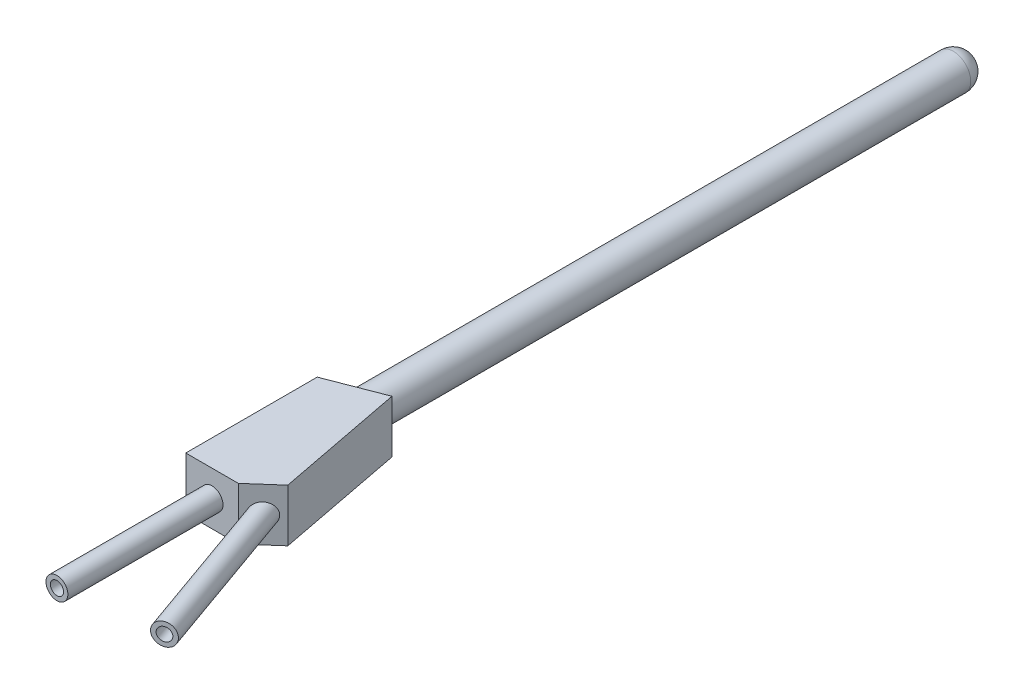
ISO-10303-21;
HEADER;
FILE_DESCRIPTION(('STEP AP214'),'2;1');
FILE_NAME('part.step','',(''),(''),'','','');
FILE_SCHEMA(('AUTOMOTIVE_DESIGN { 1 0 10303 214 1 1 1 1 }'));
ENDSEC;
DATA;
#1=APPLICATION_CONTEXT('core data for automotive mechanical design processes');
#2=APPLICATION_PROTOCOL_DEFINITION('international standard','automotive_design',2000,#1);
#3=PRODUCT_CONTEXT('',#1,'mechanical');
#4=PRODUCT('Part','Part','',(#3));
#5=PRODUCT_RELATED_PRODUCT_CATEGORY('part','',(#4));
#6=PRODUCT_DEFINITION_FORMATION('','',#4);
#7=PRODUCT_DEFINITION_CONTEXT('part definition',#1,'design');
#8=PRODUCT_DEFINITION('design','',#6,#7);
#9=PRODUCT_DEFINITION_SHAPE('','',#8);
#10=(LENGTH_UNIT() NAMED_UNIT(*) SI_UNIT(.MILLI.,.METRE.));
#11=(NAMED_UNIT(*) PLANE_ANGLE_UNIT() SI_UNIT($,.RADIAN.));
#12=(NAMED_UNIT(*) SI_UNIT($,.STERADIAN.) SOLID_ANGLE_UNIT());
#13=UNCERTAINTY_MEASURE_WITH_UNIT(LENGTH_MEASURE(1.E-05),#10,'distance_accuracy_value','');
#14=(GEOMETRIC_REPRESENTATION_CONTEXT(3) GLOBAL_UNCERTAINTY_ASSIGNED_CONTEXT((#13)) GLOBAL_UNIT_ASSIGNED_CONTEXT((#10,
#11,#12)) REPRESENTATION_CONTEXT('',''));
#15=CARTESIAN_POINT('',(0.,0.,0.));
#16=DIRECTION('',(0.,0.,1.));
#17=DIRECTION('',(1.,0.,0.));
#18=AXIS2_PLACEMENT_3D('',#15,#16,#17);
#19=CARTESIAN_POINT('',(9.,6.,12.3542486889354));
#20=DIRECTION('',(-0.661437827766148,0.,-0.75));
#21=DIRECTION('',(-0.75,0.,0.661437827766148));
#22=AXIS2_PLACEMENT_3D('',#19,#20,#21);
#23=PLANE('',#22);
#24=DIRECTION('',(0.75,0.,-0.661437827766148));
#25=VECTOR('',#24,1.);
#26=CARTESIAN_POINT('',(9.,0.,12.3542486889354));
#27=LINE('',#26,#25);
#28=CARTESIAN_POINT('',(6.,0.,15.));
#29=VERTEX_POINT('',#28);
#30=CARTESIAN_POINT('',(9.,0.,12.3542486889354));
#31=VERTEX_POINT('',#30);
#32=EDGE_CURVE('E107',#29,#31,#27,.T.);
#33=ORIENTED_EDGE('',*,*,#32,.T.);
#34=DIRECTION('',(0.,-1.,0.));
#35=VECTOR('',#34,1.);
#36=CARTESIAN_POINT('',(9.,6.,12.3542486889354));
#37=LINE('',#36,#35);
#38=CARTESIAN_POINT('',(9.,6.,12.3542486889354));
#39=VERTEX_POINT('',#38);
#40=EDGE_CURVE('E104',#39,#31,#37,.T.);
#41=ORIENTED_EDGE('',*,*,#40,.F.);
#42=DIRECTION('',(0.75,0.,-0.661437827766148));
#43=VECTOR('',#42,1.);
#44=CARTESIAN_POINT('',(9.,6.,12.3542486889354));
#45=LINE('',#44,#43);
#46=CARTESIAN_POINT('',(6.,6.,15.));
#47=VERTEX_POINT('',#46);
#48=EDGE_CURVE('E96',#47,#39,#45,.T.);
#49=ORIENTED_EDGE('',*,*,#48,.F.);
#50=DIRECTION('',(0.,-1.,0.));
#51=VECTOR('',#50,1.);
#52=CARTESIAN_POINT('',(6.,6.,15.));
#53=LINE('',#52,#51);
#54=EDGE_CURVE('E108',#47,#29,#53,.T.);
#55=ORIENTED_EDGE('',*,*,#54,.T.);
#56=EDGE_LOOP('',(#33,#41,#49,#55));
#57=FACE_BOUND('',#56,.T.);
#58=CARTESIAN_POINT('',(7.50076638510216,3.,13.6764484563381));
#59=DIRECTION('',(-0.661437827766148,0.,-0.75));
#60=DIRECTION('',(0.75,0.,-0.661437827766148));
#61=AXIS2_PLACEMENT_3D('',#58,#59,#60);
#62=ELLIPSE('',#61,1.34702031886598,1.25);
#63=CARTESIAN_POINT('',(8.51103162425165,3.,12.7854782626705));
#64=VERTEX_POINT('',#63);
#65=EDGE_CURVE('E11',#64,#64,#62,.F.);
#66=ORIENTED_EDGE('',*,*,#65,.F.);
#67=EDGE_LOOP('',(#66));
#68=FACE_BOUND('',#67,.T.);
#69=ADVANCED_FACE('F36',(#57,#68),#23,.F.);
#70=CARTESIAN_POINT('',(0.,6.,15.));
#71=DIRECTION('',(1.,0.,0.));
#72=DIRECTION('',(0.,0.,-1.));
#73=AXIS2_PLACEMENT_3D('',#70,#71,#72);
#74=PLANE('',#73);
#75=DIRECTION('',(0.,0.,1.));
#76=VECTOR('',#75,1.);
#77=CARTESIAN_POINT('',(0.,0.,15.));
#78=LINE('',#77,#76);
#79=CARTESIAN_POINT('',(0.,0.,0.));
#80=VERTEX_POINT('',#79);
#81=CARTESIAN_POINT('',(0.,0.,15.));
#82=VERTEX_POINT('',#81);
#83=EDGE_CURVE('E117',#80,#82,#78,.T.);
#84=ORIENTED_EDGE('',*,*,#83,.T.);
#85=DIRECTION('',(0.,-1.,0.));
#86=VECTOR('',#85,1.);
#87=CARTESIAN_POINT('',(0.,6.,15.));
#88=LINE('',#87,#86);
#89=CARTESIAN_POINT('',(0.,6.,15.));
#90=VERTEX_POINT('',#89);
#91=EDGE_CURVE('E130',#90,#82,#88,.T.);
#92=ORIENTED_EDGE('',*,*,#91,.F.);
#93=DIRECTION('',(0.,0.,1.));
#94=VECTOR('',#93,1.);
#95=CARTESIAN_POINT('',(0.,6.,15.));
#96=LINE('',#95,#94);
#97=CARTESIAN_POINT('',(0.,6.,0.));
#98=VERTEX_POINT('',#97);
#99=EDGE_CURVE('E126',#98,#90,#96,.T.);
#100=ORIENTED_EDGE('',*,*,#99,.F.);
#101=DIRECTION('',(0.,-1.,0.));
#102=VECTOR('',#101,1.);
#103=CARTESIAN_POINT('',(0.,6.,0.));
#104=LINE('',#103,#102);
#105=EDGE_CURVE('E113',#98,#80,#104,.T.);
#106=ORIENTED_EDGE('',*,*,#105,.T.);
#107=EDGE_LOOP('',(#84,#92,#100,#106));
#108=FACE_BOUND('',#107,.T.);
#109=ADVANCED_FACE('F148',(#108),#74,.F.);
#110=CARTESIAN_POINT('',(6.,6.,15.));
#111=DIRECTION('',(0.,0.,-1.));
#112=DIRECTION('',(-1.,0.,0.));
#113=AXIS2_PLACEMENT_3D('',#110,#111,#112);
#114=PLANE('',#113);
#115=CARTESIAN_POINT('',(3.,3.,15.));
#116=DIRECTION('',(0.,0.,1.));
#117=DIRECTION('',(1.,0.,0.));
#118=AXIS2_PLACEMENT_3D('',#115,#116,#117);
#119=CIRCLE('',#118,1.25);
#120=CARTESIAN_POINT('',(4.25,3.,15.));
#121=VERTEX_POINT('',#120);
#122=EDGE_CURVE('E45',#121,#121,#119,.T.);
#123=ORIENTED_EDGE('',*,*,#122,.F.);
#124=EDGE_LOOP('',(#123));
#125=FACE_BOUND('',#124,.T.);
#126=DIRECTION('',(1.,0.,0.));
#127=VECTOR('',#126,1.);
#128=CARTESIAN_POINT('',(6.,0.,15.));
#129=LINE('',#128,#127);
#130=EDGE_CURVE('E120',#82,#29,#129,.T.);
#131=ORIENTED_EDGE('',*,*,#130,.T.);
#132=ORIENTED_EDGE('',*,*,#54,.F.);
#133=DIRECTION('',(1.,0.,0.));
#134=VECTOR('',#133,1.);
#135=CARTESIAN_POINT('',(6.,6.,15.));
#136=LINE('',#135,#134);
#137=EDGE_CURVE('E89',#90,#47,#136,.T.);
#138=ORIENTED_EDGE('',*,*,#137,.F.);
#139=ORIENTED_EDGE('',*,*,#91,.T.);
#140=EDGE_LOOP('',(#131,#132,#138,#139));
#141=FACE_BOUND('',#140,.T.);
#142=ADVANCED_FACE('F150',(#125,#141),#114,.F.);
#143=CARTESIAN_POINT('',(6.1582177760689,6.,-2.37410063445277));
#144=DIRECTION('',(-0.981889954892546,0.,0.189452148262074));
#145=DIRECTION('',(0.189452148262074,0.,0.981889954892546));
#146=AXIS2_PLACEMENT_3D('',#143,#144,#145);
#147=PLANE('',#146);
#148=DIRECTION('',(-0.189452148262074,0.,-0.981889954892546));
#149=VECTOR('',#148,1.);
#150=CARTESIAN_POINT('',(6.1582177760689,0.,-2.37410063445277));
#151=LINE('',#150,#149);
#152=CARTESIAN_POINT('',(6.1582177760689,0.,-2.37410063445277));
#153=VERTEX_POINT('',#152);
#154=EDGE_CURVE('E74',#31,#153,#151,.T.);
#155=ORIENTED_EDGE('',*,*,#154,.T.);
#156=DIRECTION('',(0.,-1.,0.));
#157=VECTOR('',#156,1.);
#158=CARTESIAN_POINT('',(6.1582177760689,6.,-2.37410063445277));
#159=LINE('',#158,#157);
#160=CARTESIAN_POINT('',(6.1582177760689,6.,-2.37410063445277));
#161=VERTEX_POINT('',#160);
#162=EDGE_CURVE('E109',#161,#153,#159,.T.);
#163=ORIENTED_EDGE('',*,*,#162,.F.);
#164=DIRECTION('',(-0.189452148262074,0.,-0.981889954892546));
#165=VECTOR('',#164,1.);
#166=CARTESIAN_POINT('',(6.1582177760689,6.,-2.37410063445277));
#167=LINE('',#166,#165);
#168=EDGE_CURVE('E100',#39,#161,#167,.T.);
#169=ORIENTED_EDGE('',*,*,#168,.F.);
#170=ORIENTED_EDGE('',*,*,#40,.T.);
#171=EDGE_LOOP('',(#155,#163,#169,#170));
#172=FACE_BOUND('',#171,.T.);
#173=ADVANCED_FACE('F111',(#172),#147,.F.);
#174=CARTESIAN_POINT('',(0.,6.,0.));
#175=DIRECTION('',(0.359712217341329,0.,0.933063299404378));
#176=DIRECTION('',(0.933063299404378,0.,-0.35971221734133));
#177=AXIS2_PLACEMENT_3D('',#174,#175,#176);
#178=PLANE('',#177);
#179=CARTESIAN_POINT('',(3.07910888803445,3.,-1.18705031722638));
#180=DIRECTION('',(0.359712217341329,0.,0.933063299404378));
#181=DIRECTION('',(-0.933063299404378,0.,0.35971221734133));
#182=AXIS2_PLACEMENT_3D('',#179,#180,#181);
#183=ELLIPSE('',#182,2.14347729813905,2.);
#184=CARTESIAN_POINT('',(1.07910888803445,3.,-0.416015345491981));
#185=VERTEX_POINT('',#184);
#186=EDGE_CURVE('E121',#185,#185,#183,.T.);
#187=ORIENTED_EDGE('',*,*,#186,.T.);
#188=EDGE_LOOP('',(#187));
#189=FACE_BOUND('',#188,.T.);
#190=DIRECTION('',(-0.933063299404378,0.,0.35971221734133));
#191=VECTOR('',#190,1.);
#192=CARTESIAN_POINT('',(0.,0.,0.));
#193=LINE('',#192,#191);
#194=EDGE_CURVE('E80',#153,#80,#193,.T.);
#195=ORIENTED_EDGE('',*,*,#194,.T.);
#196=ORIENTED_EDGE('',*,*,#105,.F.);
#197=DIRECTION('',(-0.933063299404378,0.,0.35971221734133));
#198=VECTOR('',#197,1.);
#199=CARTESIAN_POINT('',(0.,6.,0.));
#200=LINE('',#199,#198);
#201=EDGE_CURVE('E53',#161,#98,#200,.T.);
#202=ORIENTED_EDGE('',*,*,#201,.F.);
#203=ORIENTED_EDGE('',*,*,#162,.T.);
#204=EDGE_LOOP('',(#195,#196,#202,#203));
#205=FACE_BOUND('',#204,.T.);
#206=ADVANCED_FACE('F161',(#189,#205),#178,.F.);
#207=CARTESIAN_POINT('',(0.,6.,0.));
#208=DIRECTION('',(0.,1.,0.));
#209=DIRECTION('',(0.,0.,1.));
#210=AXIS2_PLACEMENT_3D('',#207,#208,#209);
#211=PLANE('',#210);
#212=ORIENTED_EDGE('',*,*,#99,.T.);
#213=ORIENTED_EDGE('',*,*,#137,.T.);
#214=ORIENTED_EDGE('',*,*,#48,.T.);
#215=ORIENTED_EDGE('',*,*,#168,.T.);
#216=ORIENTED_EDGE('',*,*,#201,.T.);
#217=EDGE_LOOP('',(#212,#213,#214,#215,#216));
#218=FACE_BOUND('',#217,.T.);
#219=ADVANCED_FACE('F98',(#218),#211,.T.);
#220=CARTESIAN_POINT('',(0.,0.,0.));
#221=DIRECTION('',(0.,1.,0.));
#222=DIRECTION('',(0.,0.,1.));
#223=AXIS2_PLACEMENT_3D('',#220,#221,#222);
#224=PLANE('',#223);
#225=ORIENTED_EDGE('',*,*,#83,.F.);
#226=ORIENTED_EDGE('',*,*,#194,.F.);
#227=ORIENTED_EDGE('',*,*,#154,.F.);
#228=ORIENTED_EDGE('',*,*,#32,.F.);
#229=ORIENTED_EDGE('',*,*,#130,.F.);
#230=EDGE_LOOP('',(#225,#226,#227,#228,#229));
#231=FACE_BOUND('',#230,.T.);
#232=ADVANCED_FACE('F152',(#231),#224,.F.);
#233=CARTESIAN_POINT('',(3.07910888803445,3.,-71.5));
#234=DIRECTION('',(0.,0.,1.));
#235=DIRECTION('',(1.,0.,0.));
#236=AXIS2_PLACEMENT_3D('',#233,#234,#235);
#237=CYLINDRICAL_SURFACE('',#236,2.);
#238=CARTESIAN_POINT('',(3.07910888803445,3.,-69.5));
#239=DIRECTION('',(0.,0.,1.));
#240=DIRECTION('',(1.,0.,0.));
#241=AXIS2_PLACEMENT_3D('',#238,#239,#240);
#242=CIRCLE('',#241,2.);
#243=CARTESIAN_POINT('',(5.07910888803445,3.,-69.5));
#244=VERTEX_POINT('',#243);
#245=EDGE_CURVE('E132',#244,#244,#242,.T.);
#246=ORIENTED_EDGE('',*,*,#245,.T.);
#247=EDGE_LOOP('',(#246));
#248=FACE_BOUND('',#247,.T.);
#249=ORIENTED_EDGE('',*,*,#186,.F.);
#250=EDGE_LOOP('',(#249));
#251=FACE_BOUND('',#250,.T.);
#252=ADVANCED_FACE('F154',(#248,#251),#237,.T.);
#253=CARTESIAN_POINT('',(3.07910888803445,3.,-69.5));
#254=DIRECTION('',(0.,0.,1.));
#255=DIRECTION('',(1.,0.,0.));
#256=AXIS2_PLACEMENT_3D('',#253,#254,#255);
#257=SPHERICAL_SURFACE('',#256,2.);
#258=ORIENTED_EDGE('',*,*,#245,.F.);
#259=EDGE_LOOP('',(#258));
#260=FACE_BOUND('',#259,.T.);
#261=ADVANCED_FACE('F38',(#260),#257,.T.);
#262=CARTESIAN_POINT('',(3.,3.,32.7));
#263=DIRECTION('',(0.,0.,-1.));
#264=DIRECTION('',(-1.,0.,0.));
#265=AXIS2_PLACEMENT_3D('',#262,#263,#264);
#266=CYLINDRICAL_SURFACE('',#265,1.25);
#267=CARTESIAN_POINT('',(3.,3.,32.7));
#268=DIRECTION('',(0.,0.,1.));
#269=DIRECTION('',(1.,0.,0.));
#270=AXIS2_PLACEMENT_3D('',#267,#268,#269);
#271=CIRCLE('',#270,1.25);
#272=CARTESIAN_POINT('',(4.25,3.,32.7));
#273=VERTEX_POINT('',#272);
#274=EDGE_CURVE('E134',#273,#273,#271,.T.);
#275=ORIENTED_EDGE('',*,*,#274,.F.);
#276=EDGE_LOOP('',(#275));
#277=FACE_BOUND('',#276,.T.);
#278=ORIENTED_EDGE('',*,*,#122,.T.);
#279=EDGE_LOOP('',(#278));
#280=FACE_BOUND('',#279,.T.);
#281=ADVANCED_FACE('F210',(#277,#280),#266,.T.);
#282=CARTESIAN_POINT('',(3.,3.,32.7));
#283=DIRECTION('',(0.,0.,1.));
#284=DIRECTION('',(1.,0.,0.));
#285=AXIS2_PLACEMENT_3D('',#282,#283,#284);
#286=PLANE('',#285);
#287=CARTESIAN_POINT('',(3.,3.,32.7));
#288=DIRECTION('',(0.,0.,1.));
#289=DIRECTION('',(1.,0.,0.));
#290=AXIS2_PLACEMENT_3D('',#287,#288,#289);
#291=CIRCLE('',#290,0.75);
#292=CARTESIAN_POINT('',(3.75,3.,32.7));
#293=VERTEX_POINT('',#292);
#294=EDGE_CURVE('E415',#293,#293,#291,.T.);
#295=ORIENTED_EDGE('',*,*,#294,.F.);
#296=EDGE_LOOP('',(#295));
#297=FACE_BOUND('',#296,.T.);
#298=ORIENTED_EDGE('',*,*,#274,.T.);
#299=EDGE_LOOP('',(#298));
#300=FACE_BOUND('',#299,.T.);
#301=ADVANCED_FACE('F218',(#297,#300),#286,.T.);
#302=CARTESIAN_POINT('',(13.6856973327697,3.,31.1123515986947));
#303=DIRECTION('',(-0.334313710582527,0.,-0.942461852234106));
#304=DIRECTION('',(-0.942461852234106,0.,0.334313710582527));
#305=AXIS2_PLACEMENT_3D('',#302,#303,#304);
#306=CYLINDRICAL_SURFACE('',#305,1.25);
#307=CARTESIAN_POINT('',(13.6856973327697,3.,31.1123515986947));
#308=DIRECTION('',(0.334313710582527,0.,0.942461852234106));
#309=DIRECTION('',(0.942461852234106,0.,-0.334313710582527));
#310=AXIS2_PLACEMENT_3D('',#307,#308,#309);
#311=CIRCLE('',#310,1.25);
#312=CARTESIAN_POINT('',(14.8637746480623,3.,30.6944594604665));
#313=VERTEX_POINT('',#312);
#314=EDGE_CURVE('E378',#313,#313,#311,.T.);
#315=ORIENTED_EDGE('',*,*,#314,.F.);
#316=EDGE_LOOP('',(#315));
#317=FACE_BOUND('',#316,.T.);
#318=ORIENTED_EDGE('',*,*,#65,.T.);
#319=EDGE_LOOP('',(#318));
#320=FACE_BOUND('',#319,.T.);
#321=ADVANCED_FACE('F227',(#317,#320),#306,.T.);
#322=CARTESIAN_POINT('',(13.6856973327697,3.,31.1123515986947));
#323=DIRECTION('',(0.334313710582527,0.,0.942461852234106));
#324=DIRECTION('',(0.942461852234106,0.,-0.334313710582527));
#325=AXIS2_PLACEMENT_3D('',#322,#323,#324);
#326=PLANE('',#325);
#327=CARTESIAN_POINT('',(13.6856973327697,3.,31.1123515986947));
#328=DIRECTION('',(0.334313710582527,0.,0.942461852234106));
#329=DIRECTION('',(0.942461852234106,0.,-0.334313710582527));
#330=AXIS2_PLACEMENT_3D('',#327,#328,#329);
#331=CIRCLE('',#330,0.75);
#332=CARTESIAN_POINT('',(14.3925437219453,3.,30.8616163157578));
#333=VERTEX_POINT('',#332);
#334=EDGE_CURVE('E373',#333,#333,#331,.T.);
#335=ORIENTED_EDGE('',*,*,#334,.F.);
#336=EDGE_LOOP('',(#335));
#337=FACE_BOUND('',#336,.T.);
#338=ORIENTED_EDGE('',*,*,#314,.T.);
#339=EDGE_LOOP('',(#338));
#340=FACE_BOUND('',#339,.T.);
#341=ADVANCED_FACE('F243',(#337,#340),#326,.T.);
#342=CARTESIAN_POINT('',(8.66928108611692,6.,11.9792486889354));
#343=DIRECTION('',(-0.661437827766148,0.,-0.75));
#344=DIRECTION('',(-0.75,0.,0.661437827766148));
#345=AXIS2_PLACEMENT_3D('',#342,#343,#344);
#346=PLANE('',#345);
#347=DIRECTION('',(0.75,0.,-0.661437827766148));
#348=VECTOR('',#347,1.);
#349=CARTESIAN_POINT('',(8.66928108611692,0.5,11.9792486889354));
#350=LINE('',#349,#348);
#351=CARTESIAN_POINT('',(5.81101776349539,0.5,14.5));
#352=VERTEX_POINT('',#351);
#353=CARTESIAN_POINT('',(8.4549023362924,0.5,12.1683129750729));
#354=VERTEX_POINT('',#353);
#355=EDGE_CURVE('E392',#352,#354,#350,.T.);
#356=ORIENTED_EDGE('',*,*,#355,.F.);
#357=DIRECTION('',(0.,-1.,0.));
#358=VECTOR('',#357,1.);
#359=CARTESIAN_POINT('',(5.81101776349539,6.,14.5));
#360=LINE('',#359,#358);
#361=CARTESIAN_POINT('',(5.81101776349539,5.5,14.5));
#362=VERTEX_POINT('',#361);
#363=EDGE_CURVE('E386',#362,#352,#360,.T.);
#364=ORIENTED_EDGE('',*,*,#363,.F.);
#365=DIRECTION('',(0.75,0.,-0.661437827766148));
#366=VECTOR('',#365,1.);
#367=CARTESIAN_POINT('',(8.66928108611692,5.5,11.9792486889354));
#368=LINE('',#367,#366);
#369=CARTESIAN_POINT('',(8.4549023362924,5.5,12.1683129750729));
#370=VERTEX_POINT('',#369);
#371=EDGE_CURVE('E397',#362,#370,#368,.T.);
#372=ORIENTED_EDGE('',*,*,#371,.T.);
#373=DIRECTION('',(0.,-1.,0.));
#374=VECTOR('',#373,1.);
#375=CARTESIAN_POINT('',(8.4549023362924,6.,12.1683129750729));
#376=LINE('',#375,#374);
#377=EDGE_CURVE('E424',#370,#354,#376,.T.);
#378=ORIENTED_EDGE('',*,*,#377,.T.);
#379=EDGE_LOOP('',(#356,#364,#372,#378));
#380=FACE_BOUND('',#379,.T.);
#381=CARTESIAN_POINT('',(7.3206354406901,3.,13.1686423504519));
#382=DIRECTION('',(-0.661437827766148,0.,-0.75));
#383=DIRECTION('',(0.75,0.,-0.661437827766148));
#384=AXIS2_PLACEMENT_3D('',#381,#382,#383);
#385=ELLIPSE('',#384,0.80821219131959,0.75);
#386=CARTESIAN_POINT('',(7.9267945841798,3.,12.6340602342514));
#387=VERTEX_POINT('',#386);
#388=EDGE_CURVE('E376',#387,#387,#385,.F.);
#389=ORIENTED_EDGE('',*,*,#388,.T.);
#390=EDGE_LOOP('',(#389));
#391=FACE_BOUND('',#390,.T.);
#392=ADVANCED_FACE('F253',(#380,#391),#346,.T.);
#393=CARTESIAN_POINT('',(0.5,6.,15.));
#394=DIRECTION('',(1.,0.,0.));
#395=DIRECTION('',(0.,0.,-1.));
#396=AXIS2_PLACEMENT_3D('',#393,#394,#395);
#397=PLANE('',#396);
#398=DIRECTION('',(0.,0.,1.));
#399=VECTOR('',#398,1.);
#400=CARTESIAN_POINT('',(0.5,0.5,15.));
#401=LINE('',#400,#399);
#402=CARTESIAN_POINT('',(0.5,0.5,0.343110581601162));
#403=VERTEX_POINT('',#402);
#404=CARTESIAN_POINT('',(0.5,0.5,14.5));
#405=VERTEX_POINT('',#404);
#406=EDGE_CURVE('E393',#403,#405,#401,.T.);
#407=ORIENTED_EDGE('',*,*,#406,.F.);
#408=DIRECTION('',(0.,-1.,0.));
#409=VECTOR('',#408,1.);
#410=CARTESIAN_POINT('',(0.5,6.,0.343110581601162));
#411=LINE('',#410,#409);
#412=CARTESIAN_POINT('',(0.5,5.5,0.343110581601162));
#413=VERTEX_POINT('',#412);
#414=EDGE_CURVE('E408',#413,#403,#411,.T.);
#415=ORIENTED_EDGE('',*,*,#414,.F.);
#416=DIRECTION('',(0.,0.,1.));
#417=VECTOR('',#416,1.);
#418=CARTESIAN_POINT('',(0.5,5.5,15.));
#419=LINE('',#418,#417);
#420=CARTESIAN_POINT('',(0.5,5.5,14.5));
#421=VERTEX_POINT('',#420);
#422=EDGE_CURVE('E398',#413,#421,#419,.T.);
#423=ORIENTED_EDGE('',*,*,#422,.T.);
#424=DIRECTION('',(0.,-1.,0.));
#425=VECTOR('',#424,1.);
#426=CARTESIAN_POINT('',(0.5,6.,14.5));
#427=LINE('',#426,#425);
#428=EDGE_CURVE('E399',#421,#405,#427,.T.);
#429=ORIENTED_EDGE('',*,*,#428,.T.);
#430=EDGE_LOOP('',(#407,#415,#423,#429));
#431=FACE_BOUND('',#430,.T.);
#432=ADVANCED_FACE('F263',(#431),#397,.T.);
#433=CARTESIAN_POINT('',(6.,6.,14.5));
#434=DIRECTION('',(0.,0.,-1.));
#435=DIRECTION('',(-1.,0.,0.));
#436=AXIS2_PLACEMENT_3D('',#433,#434,#435);
#437=PLANE('',#436);
#438=CARTESIAN_POINT('',(3.,3.,14.5));
#439=DIRECTION('',(0.,0.,-1.));
#440=DIRECTION('',(-1.,0.,0.));
#441=AXIS2_PLACEMENT_3D('',#438,#439,#440);
#442=CIRCLE('',#441,0.75);
#443=CARTESIAN_POINT('',(2.25,3.,14.5));
#444=VERTEX_POINT('',#443);
#445=EDGE_CURVE('E379',#444,#444,#442,.F.);
#446=ORIENTED_EDGE('',*,*,#445,.T.);
#447=EDGE_LOOP('',(#446));
#448=FACE_BOUND('',#447,.T.);
#449=DIRECTION('',(1.,0.,0.));
#450=VECTOR('',#449,1.);
#451=CARTESIAN_POINT('',(6.,0.5,14.5));
#452=LINE('',#451,#450);
#453=EDGE_CURVE('E389',#405,#352,#452,.T.);
#454=ORIENTED_EDGE('',*,*,#453,.F.);
#455=ORIENTED_EDGE('',*,*,#428,.F.);
#456=DIRECTION('',(1.,0.,0.));
#457=VECTOR('',#456,1.);
#458=CARTESIAN_POINT('',(6.,5.5,14.5));
#459=LINE('',#458,#457);
#460=EDGE_CURVE('E394',#421,#362,#459,.T.);
#461=ORIENTED_EDGE('',*,*,#460,.T.);
#462=ORIENTED_EDGE('',*,*,#363,.T.);
#463=EDGE_LOOP('',(#454,#455,#461,#462));
#464=FACE_BOUND('',#463,.T.);
#465=ADVANCED_FACE('F273',(#448,#464),#437,.T.);
#466=CARTESIAN_POINT('',(5.66727279862262,6.,-2.27937456032174));
#467=DIRECTION('',(-0.981889954892546,0.,0.189452148262074));
#468=DIRECTION('',(0.189452148262074,0.,0.981889954892546));
#469=AXIS2_PLACEMENT_3D('',#466,#467,#468);
#470=PLANE('',#469);
#471=DIRECTION('',(-0.189452148262074,0.,-0.981889954892546));
#472=VECTOR('',#471,1.);
#473=CARTESIAN_POINT('',(5.66727279862262,0.5,-2.27937456032174));
#474=LINE('',#473,#472);
#475=CARTESIAN_POINT('',(5.78048701503771,0.5,-1.69260949659057));
#476=VERTEX_POINT('',#475);
#477=EDGE_CURVE('E418',#354,#476,#474,.T.);
#478=ORIENTED_EDGE('',*,*,#477,.F.);
#479=ORIENTED_EDGE('',*,*,#377,.F.);
#480=DIRECTION('',(-0.189452148262074,0.,-0.981889954892546));
#481=VECTOR('',#480,1.);
#482=CARTESIAN_POINT('',(5.66727279862262,5.5,-2.27937456032174));
#483=LINE('',#482,#481);
#484=CARTESIAN_POINT('',(5.78048701503771,5.5,-1.69260949659057));
#485=VERTEX_POINT('',#484);
#486=EDGE_CURVE('E421',#370,#485,#483,.T.);
#487=ORIENTED_EDGE('',*,*,#486,.T.);
#488=DIRECTION('',(0.,-1.,0.));
#489=VECTOR('',#488,1.);
#490=CARTESIAN_POINT('',(5.78048701503771,6.,-1.69260949659057));
#491=LINE('',#490,#489);
#492=EDGE_CURVE('E411',#485,#476,#491,.T.);
#493=ORIENTED_EDGE('',*,*,#492,.T.);
#494=EDGE_LOOP('',(#478,#479,#487,#493));
#495=FACE_BOUND('',#494,.T.);
#496=ADVANCED_FACE('F283',(#495),#470,.T.);
#497=CARTESIAN_POINT('',(0.179856108670665,6.,0.466531649702189));
#498=DIRECTION('',(0.359712217341329,0.,0.933063299404378));
#499=DIRECTION('',(0.933063299404378,0.,-0.35971221734133));
#500=AXIS2_PLACEMENT_3D('',#497,#498,#499);
#501=PLANE('',#500);
#502=CARTESIAN_POINT('',(3.07910888803445,3.,-0.651180992691638));
#503=DIRECTION('',(0.359712217341329,0.,0.933063299404378));
#504=DIRECTION('',(-0.933063299404378,0.,0.35971221734133));
#505=AXIS2_PLACEMENT_3D('',#502,#503,#504);
#506=ELLIPSE('',#505,1.60760797360428,1.5);
#507=CARTESIAN_POINT('',(1.57910888803445,3.,-0.0729047638908395));
#508=VERTEX_POINT('',#507);
#509=EDGE_CURVE('E404',#508,#508,#506,.T.);
#510=ORIENTED_EDGE('',*,*,#509,.F.);
#511=EDGE_LOOP('',(#510));
#512=FACE_BOUND('',#511,.T.);
#513=DIRECTION('',(-0.933063299404378,0.,0.35971221734133));
#514=VECTOR('',#513,1.);
#515=CARTESIAN_POINT('',(0.179856108670665,0.5,0.466531649702189));
#516=LINE('',#515,#514);
#517=EDGE_CURVE('E407',#476,#403,#516,.T.);
#518=ORIENTED_EDGE('',*,*,#517,.F.);
#519=ORIENTED_EDGE('',*,*,#492,.F.);
#520=DIRECTION('',(-0.933063299404378,0.,0.35971221734133));
#521=VECTOR('',#520,1.);
#522=CARTESIAN_POINT('',(0.179856108670665,5.5,0.466531649702189));
#523=LINE('',#522,#521);
#524=EDGE_CURVE('E412',#485,#413,#523,.T.);
#525=ORIENTED_EDGE('',*,*,#524,.T.);
#526=ORIENTED_EDGE('',*,*,#414,.T.);
#527=EDGE_LOOP('',(#518,#519,#525,#526));
#528=FACE_BOUND('',#527,.T.);
#529=ADVANCED_FACE('F293',(#512,#528),#501,.T.);
#530=CARTESIAN_POINT('',(0.,5.5,0.));
#531=DIRECTION('',(0.,1.,0.));
#532=DIRECTION('',(0.,0.,1.));
#533=AXIS2_PLACEMENT_3D('',#530,#531,#532);
#534=PLANE('',#533);
#535=ORIENTED_EDGE('',*,*,#422,.F.);
#536=ORIENTED_EDGE('',*,*,#524,.F.);
#537=ORIENTED_EDGE('',*,*,#486,.F.);
#538=ORIENTED_EDGE('',*,*,#371,.F.);
#539=ORIENTED_EDGE('',*,*,#460,.F.);
#540=EDGE_LOOP('',(#535,#536,#537,#538,#539));
#541=FACE_BOUND('',#540,.T.);
#542=ADVANCED_FACE('F303',(#541),#534,.F.);
#543=CARTESIAN_POINT('',(0.,0.5,0.));
#544=DIRECTION('',(0.,1.,0.));
#545=DIRECTION('',(0.,0.,1.));
#546=AXIS2_PLACEMENT_3D('',#543,#544,#545);
#547=PLANE('',#546);
#548=ORIENTED_EDGE('',*,*,#406,.T.);
#549=ORIENTED_EDGE('',*,*,#453,.T.);
#550=ORIENTED_EDGE('',*,*,#355,.T.);
#551=ORIENTED_EDGE('',*,*,#477,.T.);
#552=ORIENTED_EDGE('',*,*,#517,.T.);
#553=EDGE_LOOP('',(#548,#549,#550,#551,#552));
#554=FACE_BOUND('',#553,.T.);
#555=ADVANCED_FACE('F313',(#554),#547,.T.);
#556=CARTESIAN_POINT('',(3.07910888803445,3.,-71.5));
#557=DIRECTION('',(0.,0.,1.));
#558=DIRECTION('',(1.,0.,0.));
#559=AXIS2_PLACEMENT_3D('',#556,#557,#558);
#560=CYLINDRICAL_SURFACE('',#559,1.5);
#561=CARTESIAN_POINT('',(3.07910888803445,3.,-69.5));
#562=DIRECTION('',(0.,0.,1.));
#563=DIRECTION('',(1.,0.,0.));
#564=AXIS2_PLACEMENT_3D('',#561,#562,#563);
#565=CIRCLE('',#564,1.5);
#566=CARTESIAN_POINT('',(4.57910888803445,3.,-69.5));
#567=VERTEX_POINT('',#566);
#568=EDGE_CURVE('E383',#567,#567,#565,.T.);
#569=ORIENTED_EDGE('',*,*,#568,.F.);
#570=EDGE_LOOP('',(#569));
#571=FACE_BOUND('',#570,.T.);
#572=ORIENTED_EDGE('',*,*,#509,.T.);
#573=EDGE_LOOP('',(#572));
#574=FACE_BOUND('',#573,.T.);
#575=ADVANCED_FACE('F323',(#571,#574),#560,.F.);
#576=CARTESIAN_POINT('',(3.07910888803445,3.,-69.5));
#577=DIRECTION('',(0.,0.,1.));
#578=DIRECTION('',(1.,0.,0.));
#579=AXIS2_PLACEMENT_3D('',#576,#577,#578);
#580=SPHERICAL_SURFACE('',#579,1.5);
#581=ORIENTED_EDGE('',*,*,#568,.T.);
#582=EDGE_LOOP('',(#581));
#583=FACE_BOUND('',#582,.T.);
#584=ADVANCED_FACE('F333',(#583),#580,.F.);
#585=CARTESIAN_POINT('',(3.,3.,32.7));
#586=DIRECTION('',(0.,0.,-1.));
#587=DIRECTION('',(-1.,0.,0.));
#588=AXIS2_PLACEMENT_3D('',#585,#586,#587);
#589=CYLINDRICAL_SURFACE('',#588,0.75);
#590=ORIENTED_EDGE('',*,*,#294,.T.);
#591=EDGE_LOOP('',(#590));
#592=FACE_BOUND('',#591,.T.);
#593=ORIENTED_EDGE('',*,*,#445,.F.);
#594=EDGE_LOOP('',(#593));
#595=FACE_BOUND('',#594,.T.);
#596=ADVANCED_FACE('F343',(#592,#595),#589,.F.);
#597=CARTESIAN_POINT('',(13.6856973327697,3.,31.1123515986947));
#598=DIRECTION('',(-0.334313710582527,0.,-0.942461852234106));
#599=DIRECTION('',(-0.942461852234106,0.,0.334313710582527));
#600=AXIS2_PLACEMENT_3D('',#597,#598,#599);
#601=CYLINDRICAL_SURFACE('',#600,0.75);
#602=ORIENTED_EDGE('',*,*,#334,.T.);
#603=EDGE_LOOP('',(#602));
#604=FACE_BOUND('',#603,.T.);
#605=ORIENTED_EDGE('',*,*,#388,.F.);
#606=EDGE_LOOP('',(#605));
#607=FACE_BOUND('',#606,.T.);
#608=ADVANCED_FACE('F353',(#604,#607),#601,.F.);
#609=CLOSED_SHELL('',(#69,#109,#142,#173,#206,#219,#232,#252,#261,#281,#301,#321,#341,#392,#432,
#465,#496,#529,#542,#555,#575,#584,#596,#608));
#610=MANIFOLD_SOLID_BREP('B2',#609);
#611=ADVANCED_BREP_SHAPE_REPRESENTATION('',(#18,#610),#14);
#612=SHAPE_DEFINITION_REPRESENTATION(#9,#611);
ENDSEC;
END-ISO-10303-21;
